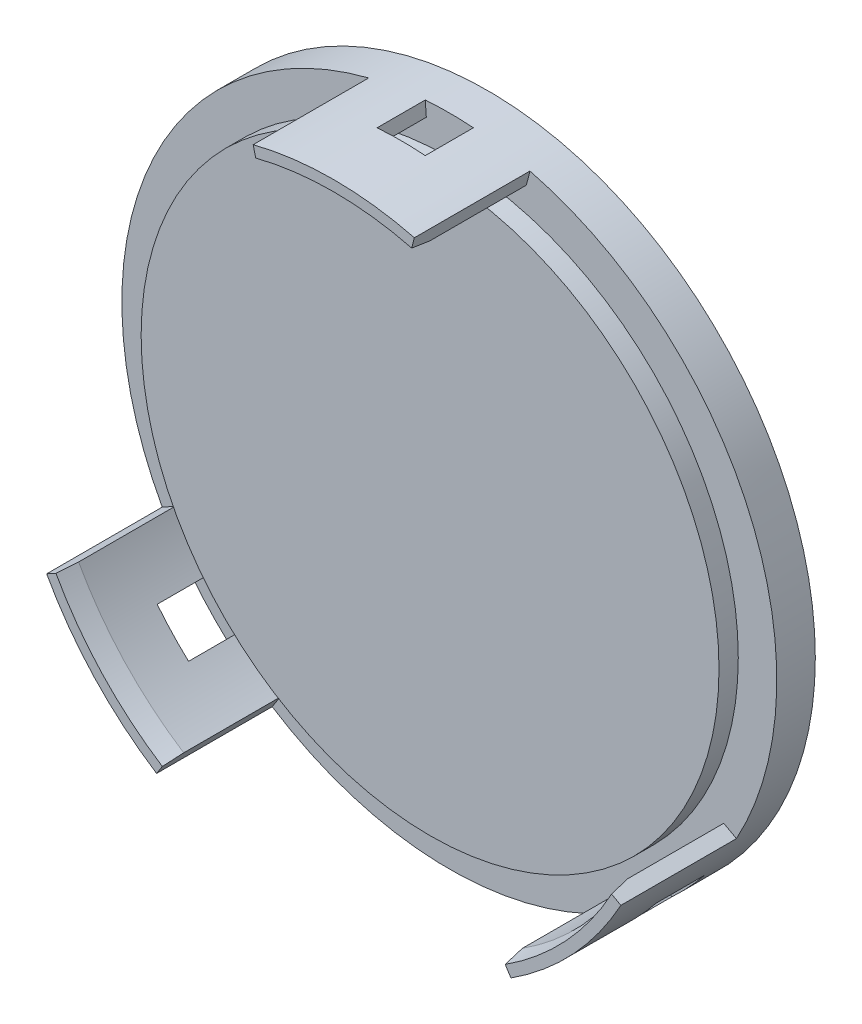
ISO-10303-21;
HEADER;
FILE_DESCRIPTION(('STEP AP214'),'2;1');
FILE_NAME('part.step','',(''),(''),'','','');
FILE_SCHEMA(('AUTOMOTIVE_DESIGN { 1 0 10303 214 1 1 1 1 }'));
ENDSEC;
DATA;
#1=APPLICATION_CONTEXT('core data for automotive mechanical design processes');
#2=APPLICATION_PROTOCOL_DEFINITION('international standard','automotive_design',2000,#1);
#3=PRODUCT_CONTEXT('',#1,'mechanical');
#4=PRODUCT('Part','Part','',(#3));
#5=PRODUCT_RELATED_PRODUCT_CATEGORY('part','',(#4));
#6=PRODUCT_DEFINITION_FORMATION('','',#4);
#7=PRODUCT_DEFINITION_CONTEXT('part definition',#1,'design');
#8=PRODUCT_DEFINITION('design','',#6,#7);
#9=PRODUCT_DEFINITION_SHAPE('','',#8);
#10=(LENGTH_UNIT() NAMED_UNIT(*) SI_UNIT(.MILLI.,.METRE.));
#11=(NAMED_UNIT(*) PLANE_ANGLE_UNIT() SI_UNIT($,.RADIAN.));
#12=(NAMED_UNIT(*) SI_UNIT($,.STERADIAN.) SOLID_ANGLE_UNIT());
#13=UNCERTAINTY_MEASURE_WITH_UNIT(LENGTH_MEASURE(1.E-05),#10,'distance_accuracy_value','');
#14=(GEOMETRIC_REPRESENTATION_CONTEXT(3) GLOBAL_UNCERTAINTY_ASSIGNED_CONTEXT((#13)) GLOBAL_UNIT_ASSIGNED_CONTEXT((#10,
#11,#12)) REPRESENTATION_CONTEXT('',''));
#15=CARTESIAN_POINT('',(0.,0.,0.));
#16=DIRECTION('',(0.,0.,1.));
#17=DIRECTION('',(1.,0.,0.));
#18=AXIS2_PLACEMENT_3D('',#15,#16,#17);
#19=CARTESIAN_POINT('',(0.,0.,2.));
#20=DIRECTION('',(0.,0.,1.));
#21=DIRECTION('',(1.,0.,0.));
#22=AXIS2_PLACEMENT_3D('',#19,#20,#21);
#23=PLANE('',#22);
#24=CARTESIAN_POINT('',(0.,0.,2.));
#25=DIRECTION('',(0.,0.,1.));
#26=DIRECTION('',(1.,0.,0.));
#27=AXIS2_PLACEMENT_3D('',#24,#25,#26);
#28=CIRCLE('',#27,15.);
#29=CARTESIAN_POINT('',(15.,0.,2.));
#30=VERTEX_POINT('',#29);
#31=EDGE_CURVE('E397',#30,#30,#28,.T.);
#32=ORIENTED_EDGE('',*,*,#31,.F.);
#33=EDGE_LOOP('',(#32));
#34=FACE_BOUND('',#33,.T.);
#35=CARTESIAN_POINT('',(0.,0.,2.));
#36=DIRECTION('',(0.,0.,1.));
#37=DIRECTION('',(-0.681998360062502,0.731353701619167,0.));
#38=AXIS2_PLACEMENT_3D('',#35,#36,#37);
#39=CIRCLE('',#38,16.2500000000001);
#40=CARTESIAN_POINT('',(-8.79082736025187,-13.6668889774611,2.));
#41=VERTEX_POINT('',#40);
#42=CARTESIAN_POINT('',(-11.0374391522415,-11.9263337602369,2.));
#43=VERTEX_POINT('',#42);
#44=EDGE_CURVE('E297',#41,#43,#39,.F.);
#45=ORIENTED_EDGE('',*,*,#44,.F.);
#46=DIRECTION('',(0.540973991400115,0.841039321689913,0.));
#47=VECTOR('',#46,1.);
#48=CARTESIAN_POINT('',(0.,0.,2.));
#49=LINE('',#48,#47);
#50=CARTESIAN_POINT('',(-9.19655785380195,-14.2976684687285,2.));
#51=VERTEX_POINT('',#50);
#52=EDGE_CURVE('E292',#51,#41,#49,.T.);
#53=ORIENTED_EDGE('',*,*,#52,.F.);
#54=CARTESIAN_POINT('',(0.,0.,2.));
#55=DIRECTION('',(0.,0.,1.));
#56=DIRECTION('',(1.,0.,0.));
#57=AXIS2_PLACEMENT_3D('',#54,#55,#56);
#58=CIRCLE('',#57,17.);
#59=CARTESIAN_POINT('',(9.19655785380194,-14.2976684687285,2.));
#60=VERTEX_POINT('',#59);
#61=EDGE_CURVE('E404',#51,#60,#58,.T.);
#62=ORIENTED_EDGE('',*,*,#61,.T.);
#63=DIRECTION('',(-0.540973991400114,0.841039321689914,0.));
#64=VECTOR('',#63,1.);
#65=CARTESIAN_POINT('',(0.,0.,2.));
#66=LINE('',#65,#64);
#67=CARTESIAN_POINT('',(8.79082736025186,-13.6668889774611,2.));
#68=VERTEX_POINT('',#67);
#69=EDGE_CURVE('E316',#60,#68,#66,.T.);
#70=ORIENTED_EDGE('',*,*,#69,.T.);
#71=CARTESIAN_POINT('',(0.,0.,2.));
#72=DIRECTION('',(0.,0.,1.));
#73=DIRECTION('',(-0.681998360062502,-0.731353701619167,0.));
#74=AXIS2_PLACEMENT_3D('',#71,#72,#73);
#75=CIRCLE('',#74,16.2500000000001);
#76=CARTESIAN_POINT('',(11.0374391522415,-11.9263337602369,2.));
#77=VERTEX_POINT('',#76);
#78=EDGE_CURVE('E324',#77,#68,#75,.F.);
#79=ORIENTED_EDGE('',*,*,#78,.F.);
#80=DIRECTION('',(-0.679227024753326,0.733928231399191,0.));
#81=VECTOR('',#80,1.);
#82=CARTESIAN_POINT('',(0.,0.,2.));
#83=LINE('',#82,#81);
#84=CARTESIAN_POINT('',(11.5468594208065,-12.4767799337863,2.));
#85=VERTEX_POINT('',#84);
#86=EDGE_CURVE('E241',#85,#77,#83,.T.);
#87=ORIENTED_EDGE('',*,*,#86,.F.);
#88=CARTESIAN_POINT('',(0.,0.,2.));
#89=DIRECTION('',(0.,0.,1.));
#90=DIRECTION('',(1.,0.,0.));
#91=AXIS2_PLACEMENT_3D('',#88,#89,#90);
#92=CIRCLE('',#91,17.);
#93=CARTESIAN_POINT('',(13.2518553209628,-10.6483956797383,2.));
#94=VERTEX_POINT('',#93);
#95=EDGE_CURVE('E761',#85,#94,#92,.T.);
#96=ORIENTED_EDGE('',*,*,#95,.T.);
#97=DIRECTION('',(-0.779520901233106,0.626376216455195,0.));
#98=VECTOR('',#97,1.);
#99=CARTESIAN_POINT('',(0.,0.,2.));
#100=LINE('',#99,#98);
#101=CARTESIAN_POINT('',(12.667214645038,-10.1786135173969,2.));
#102=VERTEX_POINT('',#101);
#103=EDGE_CURVE('E274',#94,#102,#100,.T.);
#104=ORIENTED_EDGE('',*,*,#103,.T.);
#105=CARTESIAN_POINT('',(14.2468142407519,-7.81605936450774,2.));
#106=VERTEX_POINT('',#105);
#107=EDGE_CURVE('E246',#106,#102,#75,.F.);
#108=ORIENTED_EDGE('',*,*,#107,.F.);
#109=DIRECTION('',(-0.876727030200116,0.480988268585092,0.));
#110=VECTOR('',#109,1.);
#111=CARTESIAN_POINT('',(0.,0.,2.));
#112=LINE('',#111,#110);
#113=CARTESIAN_POINT('',(14.904359513402,-8.17680056594656,2.));
#114=VERTEX_POINT('',#113);
#115=EDGE_CURVE('E311',#114,#106,#112,.T.);
#116=ORIENTED_EDGE('',*,*,#115,.F.);
#117=CARTESIAN_POINT('',(4.18461538461541,16.4769230769231,2.));
#118=VERTEX_POINT('',#117);
#119=EDGE_CURVE('E405',#114,#118,#58,.T.);
#120=ORIENTED_EDGE('',*,*,#119,.T.);
#121=DIRECTION('',(-0.246153846153847,-0.969230769230769,0.));
#122=VECTOR('',#121,1.);
#123=CARTESIAN_POINT('',(0.,0.,2.));
#124=LINE('',#123,#122);
#125=CARTESIAN_POINT('',(4.00000000000002,15.75,2.));
#126=VERTEX_POINT('',#125);
#127=EDGE_CURVE('E371',#118,#126,#124,.T.);
#128=ORIENTED_EDGE('',*,*,#127,.T.);
#129=CARTESIAN_POINT('',(0.,0.,2.));
#130=DIRECTION('',(0.,0.,1.));
#131=DIRECTION('',(1.,0.,0.));
#132=AXIS2_PLACEMENT_3D('',#129,#130,#131);
#133=CIRCLE('',#132,16.2500000000001);
#134=CARTESIAN_POINT('',(1.19485294117648,16.2060120464278,2.));
#135=VERTEX_POINT('',#134);
#136=EDGE_CURVE('E379',#135,#126,#133,.F.);
#137=ORIENTED_EDGE('',*,*,#136,.F.);
#138=DIRECTION('',(-0.0735294117647064,-0.99729304901094,0.));
#139=VECTOR('',#138,1.);
#140=CARTESIAN_POINT('',(0.,0.,2.));
#141=LINE('',#140,#139);
#142=CARTESIAN_POINT('',(1.25000000000001,16.953981833186,2.));
#143=VERTEX_POINT('',#142);
#144=EDGE_CURVE('E342',#143,#135,#141,.T.);
#145=ORIENTED_EDGE('',*,*,#144,.F.);
#146=CARTESIAN_POINT('',(0.,0.,2.));
#147=DIRECTION('',(0.,0.,1.));
#148=DIRECTION('',(1.,0.,0.));
#149=AXIS2_PLACEMENT_3D('',#146,#147,#148);
#150=CIRCLE('',#149,17.);
#151=CARTESIAN_POINT('',(-1.25000000000001,16.953981833186,2.));
#152=VERTEX_POINT('',#151);
#153=EDGE_CURVE('E352',#143,#152,#150,.T.);
#154=ORIENTED_EDGE('',*,*,#153,.T.);
#155=DIRECTION('',(0.0735294117647064,-0.99729304901094,0.));
#156=VECTOR('',#155,1.);
#157=CARTESIAN_POINT('',(0.,0.,2.));
#158=LINE('',#157,#156);
#159=CARTESIAN_POINT('',(-1.19485294117648,16.2060120464278,2.));
#160=VERTEX_POINT('',#159);
#161=EDGE_CURVE('E337',#152,#160,#158,.T.);
#162=ORIENTED_EDGE('',*,*,#161,.T.);
#163=CARTESIAN_POINT('',(-4.,15.75,2.));
#164=VERTEX_POINT('',#163);
#165=EDGE_CURVE('E380',#164,#160,#133,.F.);
#166=ORIENTED_EDGE('',*,*,#165,.F.);
#167=DIRECTION('',(0.246153846153846,-0.969230769230769,0.));
#168=VECTOR('',#167,1.);
#169=CARTESIAN_POINT('',(0.,0.,2.));
#170=LINE('',#169,#168);
#171=CARTESIAN_POINT('',(-4.18461538461539,16.4769230769231,2.));
#172=VERTEX_POINT('',#171);
#173=EDGE_CURVE('E358',#172,#164,#170,.T.);
#174=ORIENTED_EDGE('',*,*,#173,.F.);
#175=CARTESIAN_POINT('',(-14.904359513402,-8.17680056594654,2.));
#176=VERTEX_POINT('',#175);
#177=EDGE_CURVE('E401',#172,#176,#58,.T.);
#178=ORIENTED_EDGE('',*,*,#177,.T.);
#179=DIRECTION('',(0.876727030200117,0.480988268585091,0.));
#180=VECTOR('',#179,1.);
#181=CARTESIAN_POINT('',(0.,0.,2.));
#182=LINE('',#181,#180);
#183=CARTESIAN_POINT('',(-14.2468142407519,-7.81605936450773,2.));
#184=VERTEX_POINT('',#183);
#185=EDGE_CURVE('E287',#176,#184,#182,.T.);
#186=ORIENTED_EDGE('',*,*,#185,.T.);
#187=CARTESIAN_POINT('',(-12.667214645038,-10.1786135173969,2.));
#188=VERTEX_POINT('',#187);
#189=EDGE_CURVE('E295',#188,#184,#39,.F.);
#190=ORIENTED_EDGE('',*,*,#189,.F.);
#191=DIRECTION('',(0.779520901233106,0.626376216455195,0.));
#192=VECTOR('',#191,1.);
#193=CARTESIAN_POINT('',(0.,0.,2.));
#194=LINE('',#193,#192);
#195=CARTESIAN_POINT('',(-13.2518553209628,-10.6483956797383,2.));
#196=VERTEX_POINT('',#195);
#197=EDGE_CURVE('E257',#196,#188,#194,.T.);
#198=ORIENTED_EDGE('',*,*,#197,.F.);
#199=CARTESIAN_POINT('',(0.,0.,2.));
#200=DIRECTION('',(0.,0.,1.));
#201=DIRECTION('',(1.,0.,0.));
#202=AXIS2_PLACEMENT_3D('',#199,#200,#201);
#203=CIRCLE('',#202,17.);
#204=CARTESIAN_POINT('',(-11.5468594208065,-12.4767799337863,2.));
#205=VERTEX_POINT('',#204);
#206=EDGE_CURVE('E268',#196,#205,#203,.T.);
#207=ORIENTED_EDGE('',*,*,#206,.T.);
#208=DIRECTION('',(0.679227024753326,0.733928231399191,0.));
#209=VECTOR('',#208,1.);
#210=CARTESIAN_POINT('',(0.,0.,2.));
#211=LINE('',#210,#209);
#212=EDGE_CURVE('E266',#205,#43,#211,.T.);
#213=ORIENTED_EDGE('',*,*,#212,.T.);
#214=EDGE_LOOP('',(#45,#53,#62,#70,#79,#87,#96,#104,#108,#116,#120,#128,#137,#145,#154,#162,
#166,#174,#178,#186,#190,#198,#207,#213));
#215=FACE_BOUND('',#214,.T.);
#216=ADVANCED_FACE('F42',(#34,#215),#23,.T.);
#217=CARTESIAN_POINT('',(0.,0.,0.));
#218=DIRECTION('',(0.,0.,1.));
#219=DIRECTION('',(1.,0.,0.));
#220=AXIS2_PLACEMENT_3D('',#217,#218,#219);
#221=PLANE('',#220);
#222=CARTESIAN_POINT('',(0.,0.,0.));
#223=DIRECTION('',(0.,0.,1.));
#224=DIRECTION('',(1.,0.,0.));
#225=AXIS2_PLACEMENT_3D('',#222,#223,#224);
#226=CIRCLE('',#225,17.);
#227=CARTESIAN_POINT('',(17.,0.,0.));
#228=VERTEX_POINT('',#227);
#229=EDGE_CURVE('E400',#228,#228,#226,.T.);
#230=ORIENTED_EDGE('',*,*,#229,.F.);
#231=EDGE_LOOP('',(#230));
#232=FACE_BOUND('',#231,.T.);
#233=ADVANCED_FACE('F452',(#232),#221,.F.);
#234=CARTESIAN_POINT('',(0.,0.,2.));
#235=DIRECTION('',(0.,0.,-1.));
#236=DIRECTION('',(-1.,0.,0.));
#237=AXIS2_PLACEMENT_3D('',#234,#235,#236);
#238=CYLINDRICAL_SURFACE('',#237,17.);
#239=DIRECTION('',(0.,0.,-1.));
#240=VECTOR('',#239,1.);
#241=CARTESIAN_POINT('',(11.5468594208065,-12.4767799337863,4.5));
#242=LINE('',#241,#240);
#243=CARTESIAN_POINT('',(11.5468594208065,-12.4767799337863,4.5));
#244=VERTEX_POINT('',#243);
#245=EDGE_CURVE('E248',#244,#85,#242,.T.);
#246=ORIENTED_EDGE('',*,*,#245,.F.);
#247=CARTESIAN_POINT('',(0.,0.,4.5));
#248=DIRECTION('',(0.,0.,1.));
#249=DIRECTION('',(1.,0.,0.));
#250=AXIS2_PLACEMENT_3D('',#247,#248,#249);
#251=CIRCLE('',#250,17.);
#252=CARTESIAN_POINT('',(13.2518553209628,-10.6483956797383,4.5));
#253=VERTEX_POINT('',#252);
#254=EDGE_CURVE('E231',#244,#253,#251,.T.);
#255=ORIENTED_EDGE('',*,*,#254,.T.);
#256=DIRECTION('',(0.,0.,-1.));
#257=VECTOR('',#256,1.);
#258=CARTESIAN_POINT('',(13.2518553209628,-10.6483956797383,4.5));
#259=LINE('',#258,#257);
#260=EDGE_CURVE('E228',#253,#94,#259,.T.);
#261=ORIENTED_EDGE('',*,*,#260,.T.);
#262=ORIENTED_EDGE('',*,*,#95,.F.);
#263=EDGE_LOOP('',(#246,#255,#261,#262));
#264=FACE_BOUND('',#263,.T.);
#265=DIRECTION('',(0.,0.,-1.));
#266=VECTOR('',#265,1.);
#267=CARTESIAN_POINT('',(-13.2518553209628,-10.6483956797383,4.5));
#268=LINE('',#267,#266);
#269=CARTESIAN_POINT('',(-13.2518553209628,-10.6483956797383,4.5));
#270=VERTEX_POINT('',#269);
#271=EDGE_CURVE('E275',#270,#196,#268,.T.);
#272=ORIENTED_EDGE('',*,*,#271,.F.);
#273=CARTESIAN_POINT('',(0.,0.,4.5));
#274=DIRECTION('',(0.,0.,1.));
#275=DIRECTION('',(1.,0.,0.));
#276=AXIS2_PLACEMENT_3D('',#273,#274,#275);
#277=CIRCLE('',#276,17.);
#278=CARTESIAN_POINT('',(-11.5468594208065,-12.4767799337863,4.5));
#279=VERTEX_POINT('',#278);
#280=EDGE_CURVE('E259',#270,#279,#277,.T.);
#281=ORIENTED_EDGE('',*,*,#280,.T.);
#282=DIRECTION('',(0.,0.,-1.));
#283=VECTOR('',#282,1.);
#284=CARTESIAN_POINT('',(-11.5468594208065,-12.4767799337863,4.5));
#285=LINE('',#284,#283);
#286=EDGE_CURVE('E278',#279,#205,#285,.T.);
#287=ORIENTED_EDGE('',*,*,#286,.T.);
#288=ORIENTED_EDGE('',*,*,#206,.F.);
#289=EDGE_LOOP('',(#272,#281,#287,#288));
#290=FACE_BOUND('',#289,.T.);
#291=DIRECTION('',(0.,0.,-1.));
#292=VECTOR('',#291,1.);
#293=CARTESIAN_POINT('',(1.25000000000001,16.953981833186,4.5));
#294=LINE('',#293,#292);
#295=CARTESIAN_POINT('',(1.25000000000001,16.953981833186,4.5));
#296=VERTEX_POINT('',#295);
#297=EDGE_CURVE('E359',#296,#143,#294,.T.);
#298=ORIENTED_EDGE('',*,*,#297,.F.);
#299=CARTESIAN_POINT('',(0.,0.,4.5));
#300=DIRECTION('',(0.,0.,1.));
#301=DIRECTION('',(1.,0.,0.));
#302=AXIS2_PLACEMENT_3D('',#299,#300,#301);
#303=CIRCLE('',#302,17.);
#304=CARTESIAN_POINT('',(-1.25000000000001,16.953981833186,4.5));
#305=VERTEX_POINT('',#304);
#306=EDGE_CURVE('E344',#296,#305,#303,.T.);
#307=ORIENTED_EDGE('',*,*,#306,.T.);
#308=DIRECTION('',(0.,0.,-1.));
#309=VECTOR('',#308,1.);
#310=CARTESIAN_POINT('',(-1.25000000000001,16.953981833186,4.5));
#311=LINE('',#310,#309);
#312=EDGE_CURVE('E362',#305,#152,#311,.T.);
#313=ORIENTED_EDGE('',*,*,#312,.T.);
#314=ORIENTED_EDGE('',*,*,#153,.F.);
#315=EDGE_LOOP('',(#298,#307,#313,#314));
#316=FACE_BOUND('',#315,.T.);
#317=ORIENTED_EDGE('',*,*,#177,.F.);
#318=DIRECTION('',(0.,0.,-1.));
#319=VECTOR('',#318,1.);
#320=CARTESIAN_POINT('',(-4.18461538461539,16.4769230769231,8.));
#321=LINE('',#320,#319);
#322=CARTESIAN_POINT('',(-4.18461538461539,16.4769230769231,8.));
#323=VERTEX_POINT('',#322);
#324=EDGE_CURVE('E376',#323,#172,#321,.T.);
#325=ORIENTED_EDGE('',*,*,#324,.F.);
#326=CARTESIAN_POINT('',(0.,0.,8.));
#327=DIRECTION('',(0.,0.,1.));
#328=DIRECTION('',(1.,0.,0.));
#329=AXIS2_PLACEMENT_3D('',#326,#327,#328);
#330=CIRCLE('',#329,17.);
#331=CARTESIAN_POINT('',(4.18461538461541,16.4769230769231,8.));
#332=VERTEX_POINT('',#331);
#333=EDGE_CURVE('E374',#332,#323,#330,.T.);
#334=ORIENTED_EDGE('',*,*,#333,.F.);
#335=DIRECTION('',(0.,0.,-1.));
#336=VECTOR('',#335,1.);
#337=CARTESIAN_POINT('',(4.18461538461541,16.4769230769231,8.));
#338=LINE('',#337,#336);
#339=EDGE_CURVE('E387',#332,#118,#338,.T.);
#340=ORIENTED_EDGE('',*,*,#339,.T.);
#341=ORIENTED_EDGE('',*,*,#119,.F.);
#342=DIRECTION('',(0.,0.,-1.));
#343=VECTOR('',#342,1.);
#344=CARTESIAN_POINT('',(14.904359513402,-8.17680056594656,8.));
#345=LINE('',#344,#343);
#346=CARTESIAN_POINT('',(14.904359513402,-8.17680056594656,8.));
#347=VERTEX_POINT('',#346);
#348=EDGE_CURVE('E321',#347,#114,#345,.T.);
#349=ORIENTED_EDGE('',*,*,#348,.F.);
#350=CARTESIAN_POINT('',(0.,0.,8.));
#351=DIRECTION('',(0.,0.,1.));
#352=DIRECTION('',(-0.681998360062502,-0.731353701619167,0.));
#353=AXIS2_PLACEMENT_3D('',#350,#351,#352);
#354=CIRCLE('',#353,17.);
#355=CARTESIAN_POINT('',(9.19655785380194,-14.2976684687285,8.));
#356=VERTEX_POINT('',#355);
#357=EDGE_CURVE('E319',#356,#347,#354,.T.);
#358=ORIENTED_EDGE('',*,*,#357,.F.);
#359=DIRECTION('',(0.,0.,-1.));
#360=VECTOR('',#359,1.);
#361=CARTESIAN_POINT('',(9.19655785380194,-14.2976684687285,8.));
#362=LINE('',#361,#360);
#363=EDGE_CURVE('E330',#356,#60,#362,.T.);
#364=ORIENTED_EDGE('',*,*,#363,.T.);
#365=ORIENTED_EDGE('',*,*,#61,.F.);
#366=DIRECTION('',(0.,0.,-1.));
#367=VECTOR('',#366,1.);
#368=CARTESIAN_POINT('',(-9.19655785380195,-14.2976684687285,8.));
#369=LINE('',#368,#367);
#370=CARTESIAN_POINT('',(-9.19655785380195,-14.2976684687285,8.));
#371=VERTEX_POINT('',#370);
#372=EDGE_CURVE('E291',#371,#51,#369,.T.);
#373=ORIENTED_EDGE('',*,*,#372,.F.);
#374=CARTESIAN_POINT('',(0.,0.,8.));
#375=DIRECTION('',(0.,0.,1.));
#376=DIRECTION('',(-0.681998360062502,0.731353701619167,0.));
#377=AXIS2_PLACEMENT_3D('',#374,#375,#376);
#378=CIRCLE('',#377,17.);
#379=CARTESIAN_POINT('',(-14.904359513402,-8.17680056594654,8.));
#380=VERTEX_POINT('',#379);
#381=EDGE_CURVE('E289',#380,#371,#378,.T.);
#382=ORIENTED_EDGE('',*,*,#381,.F.);
#383=DIRECTION('',(0.,0.,-1.));
#384=VECTOR('',#383,1.);
#385=CARTESIAN_POINT('',(-14.904359513402,-8.17680056594654,8.));
#386=LINE('',#385,#384);
#387=EDGE_CURVE('E304',#380,#176,#386,.T.);
#388=ORIENTED_EDGE('',*,*,#387,.T.);
#389=EDGE_LOOP('',(#317,#325,#334,#340,#341,#349,#358,#364,#365,#373,#382,#388));
#390=FACE_BOUND('',#389,.T.);
#391=ORIENTED_EDGE('',*,*,#229,.T.);
#392=EDGE_LOOP('',(#391));
#393=FACE_BOUND('',#392,.T.);
#394=ADVANCED_FACE('F440',(#264,#290,#316,#390,#393),#238,.T.);
#395=CARTESIAN_POINT('',(0.,0.,46.4264068711929));
#396=DIRECTION('',(0.,0.,-1.));
#397=DIRECTION('',(-1.,0.,0.));
#398=AXIS2_PLACEMENT_3D('',#395,#396,#397);
#399=CYLINDRICAL_SURFACE('',#398,15.);
#400=ORIENTED_EDGE('',*,*,#31,.T.);
#401=EDGE_LOOP('',(#400));
#402=FACE_BOUND('',#401,.T.);
#403=CARTESIAN_POINT('',(0.,0.,3.));
#404=DIRECTION('',(0.,0.,1.));
#405=DIRECTION('',(1.,0.,0.));
#406=AXIS2_PLACEMENT_3D('',#403,#404,#405);
#407=CIRCLE('',#406,15.);
#408=CARTESIAN_POINT('',(15.,0.,3.));
#409=VERTEX_POINT('',#408);
#410=EDGE_CURVE('E394',#409,#409,#407,.T.);
#411=ORIENTED_EDGE('',*,*,#410,.F.);
#412=EDGE_LOOP('',(#411));
#413=FACE_BOUND('',#412,.T.);
#414=ADVANCED_FACE('F468',(#402,#413),#399,.T.);
#415=CARTESIAN_POINT('',(0.,0.,3.));
#416=DIRECTION('',(0.,0.,1.));
#417=DIRECTION('',(1.,0.,0.));
#418=AXIS2_PLACEMENT_3D('',#415,#416,#417);
#419=PLANE('',#418);
#420=ORIENTED_EDGE('',*,*,#410,.T.);
#421=EDGE_LOOP('',(#420));
#422=FACE_BOUND('',#421,.T.);
#423=ADVANCED_FACE('F463',(#422),#419,.T.);
#424=CARTESIAN_POINT('',(0.,0.,8.));
#425=DIRECTION('',(0.969230769230769,0.246153846153846,0.));
#426=DIRECTION('',(-0.246153846153846,0.969230769230769,0.));
#427=AXIS2_PLACEMENT_3D('',#424,#425,#426);
#428=PLANE('',#427);
#429=DIRECTION('',(0.,0.,-1.));
#430=VECTOR('',#429,1.);
#431=CARTESIAN_POINT('',(-4.,15.75,8.));
#432=LINE('',#431,#430);
#433=CARTESIAN_POINT('',(-4.,15.75,7.00000000000006));
#434=VERTEX_POINT('',#433);
#435=EDGE_CURVE('E392',#434,#164,#432,.T.);
#436=ORIENTED_EDGE('',*,*,#435,.F.);
#437=DIRECTION('',(-0.0482747409570909,0.190081792518545,0.980580675690921));
#438=VECTOR('',#437,1.);
#439=CARTESIAN_POINT('',(0.,0.,-74.2500000000013));
#440=LINE('',#439,#438);
#441=CARTESIAN_POINT('',(-4.04923076923077,15.9438461538461,8.));
#442=VERTEX_POINT('',#441);
#443=EDGE_CURVE('E414',#434,#442,#440,.T.);
#444=ORIENTED_EDGE('',*,*,#443,.T.);
#445=DIRECTION('',(0.246153846153846,-0.969230769230769,0.));
#446=VECTOR('',#445,1.);
#447=CARTESIAN_POINT('',(0.,0.,8.));
#448=LINE('',#447,#446);
#449=EDGE_CURVE('E367',#323,#442,#448,.T.);
#450=ORIENTED_EDGE('',*,*,#449,.F.);
#451=ORIENTED_EDGE('',*,*,#324,.T.);
#452=ORIENTED_EDGE('',*,*,#173,.T.);
#453=EDGE_LOOP('',(#436,#444,#450,#451,#452));
#454=FACE_BOUND('',#453,.T.);
#455=ADVANCED_FACE('F498',(#454),#428,.F.);
#456=CARTESIAN_POINT('',(0.,0.,8.));
#457=DIRECTION('',(0.,0.,-1.));
#458=DIRECTION('',(-1.,0.,0.));
#459=AXIS2_PLACEMENT_3D('',#456,#457,#458);
#460=CYLINDRICAL_SURFACE('',#459,16.2500000000001);
#461=DIRECTION('',(0.,0.,-1.));
#462=VECTOR('',#461,1.);
#463=CARTESIAN_POINT('',(4.00000000000002,15.75,8.));
#464=LINE('',#463,#462);
#465=CARTESIAN_POINT('',(4.00000000000002,15.75,7.00000000000006));
#466=VERTEX_POINT('',#465);
#467=EDGE_CURVE('E390',#466,#126,#464,.T.);
#468=ORIENTED_EDGE('',*,*,#467,.F.);
#469=CARTESIAN_POINT('',(0.,0.,7.00000000000006));
#470=DIRECTION('',(0.,0.,1.));
#471=DIRECTION('',(1.,0.,0.));
#472=AXIS2_PLACEMENT_3D('',#469,#470,#471);
#473=CIRCLE('',#472,16.2500000000001);
#474=EDGE_CURVE('E412',#466,#434,#473,.T.);
#475=ORIENTED_EDGE('',*,*,#474,.T.);
#476=ORIENTED_EDGE('',*,*,#435,.T.);
#477=ORIENTED_EDGE('',*,*,#165,.T.);
#478=DIRECTION('',(0.,0.,-1.));
#479=VECTOR('',#478,1.);
#480=CARTESIAN_POINT('',(-1.19485294117648,16.2060120464278,4.5));
#481=LINE('',#480,#479);
#482=CARTESIAN_POINT('',(-1.19485294117648,16.2060120464278,4.5));
#483=VERTEX_POINT('',#482);
#484=EDGE_CURVE('E350',#483,#160,#481,.T.);
#485=ORIENTED_EDGE('',*,*,#484,.F.);
#486=CARTESIAN_POINT('',(0.,0.,4.5));
#487=DIRECTION('',(0.,0.,1.));
#488=DIRECTION('',(1.,0.,0.));
#489=AXIS2_PLACEMENT_3D('',#486,#487,#488);
#490=CIRCLE('',#489,16.2500000000001);
#491=CARTESIAN_POINT('',(1.19485294117648,16.2060120464278,4.5));
#492=VERTEX_POINT('',#491);
#493=EDGE_CURVE('E338',#492,#483,#490,.T.);
#494=ORIENTED_EDGE('',*,*,#493,.F.);
#495=DIRECTION('',(0.,0.,-1.));
#496=VECTOR('',#495,1.);
#497=CARTESIAN_POINT('',(1.19485294117648,16.2060120464278,4.5));
#498=LINE('',#497,#496);
#499=EDGE_CURVE('E355',#492,#135,#498,.T.);
#500=ORIENTED_EDGE('',*,*,#499,.T.);
#501=ORIENTED_EDGE('',*,*,#136,.T.);
#502=EDGE_LOOP('',(#468,#475,#476,#477,#485,#494,#500,#501));
#503=FACE_BOUND('',#502,.T.);
#504=ADVANCED_FACE('F511',(#503),#460,.F.);
#505=CARTESIAN_POINT('',(0.,0.,8.));
#506=DIRECTION('',(0.969230769230769,-0.246153846153847,0.));
#507=DIRECTION('',(0.246153846153847,0.969230769230769,0.));
#508=AXIS2_PLACEMENT_3D('',#505,#506,#507);
#509=PLANE('',#508);
#510=DIRECTION('',(-0.246153846153847,-0.969230769230769,0.));
#511=VECTOR('',#510,1.);
#512=CARTESIAN_POINT('',(0.,0.,8.));
#513=LINE('',#512,#511);
#514=CARTESIAN_POINT('',(4.04923076923079,15.9438461538461,8.));
#515=VERTEX_POINT('',#514);
#516=EDGE_CURVE('E370',#332,#515,#513,.T.);
#517=ORIENTED_EDGE('',*,*,#516,.T.);
#518=DIRECTION('',(0.0482747409570911,0.190081792518545,0.980580675690921));
#519=VECTOR('',#518,1.);
#520=CARTESIAN_POINT('',(0.,0.,-74.2500000000013));
#521=LINE('',#520,#519);
#522=EDGE_CURVE('E410',#515,#466,#521,.F.);
#523=ORIENTED_EDGE('',*,*,#522,.T.);
#524=ORIENTED_EDGE('',*,*,#467,.T.);
#525=ORIENTED_EDGE('',*,*,#127,.F.);
#526=ORIENTED_EDGE('',*,*,#339,.F.);
#527=EDGE_LOOP('',(#517,#523,#524,#525,#526));
#528=FACE_BOUND('',#527,.T.);
#529=ADVANCED_FACE('F517',(#528),#509,.T.);
#530=CARTESIAN_POINT('',(0.,0.,8.));
#531=DIRECTION('',(0.,0.,1.));
#532=DIRECTION('',(1.,0.,0.));
#533=AXIS2_PLACEMENT_3D('',#530,#531,#532);
#534=PLANE('',#533);
#535=ORIENTED_EDGE('',*,*,#449,.T.);
#536=CARTESIAN_POINT('',(0.,0.,8.));
#537=DIRECTION('',(0.,0.,1.));
#538=DIRECTION('',(1.,0.,0.));
#539=AXIS2_PLACEMENT_3D('',#536,#537,#538);
#540=CIRCLE('',#539,16.45);
#541=EDGE_CURVE('E403',#442,#515,#540,.F.);
#542=ORIENTED_EDGE('',*,*,#541,.T.);
#543=ORIENTED_EDGE('',*,*,#516,.F.);
#544=ORIENTED_EDGE('',*,*,#333,.T.);
#545=EDGE_LOOP('',(#535,#542,#543,#544));
#546=FACE_BOUND('',#545,.T.);
#547=ADVANCED_FACE('F500',(#546),#534,.T.);
#548=CARTESIAN_POINT('',(0.,0.,4.5));
#549=DIRECTION('',(0.99729304901094,-0.0735294117647064,0.));
#550=DIRECTION('',(0.0735294117647064,0.99729304901094,0.));
#551=AXIS2_PLACEMENT_3D('',#548,#549,#550);
#552=PLANE('',#551);
#553=ORIENTED_EDGE('',*,*,#144,.T.);
#554=ORIENTED_EDGE('',*,*,#499,.F.);
#555=DIRECTION('',(-0.0735294117647064,-0.99729304901094,0.));
#556=VECTOR('',#555,1.);
#557=CARTESIAN_POINT('',(0.,0.,4.5));
#558=LINE('',#557,#556);
#559=EDGE_CURVE('E347',#296,#492,#558,.T.);
#560=ORIENTED_EDGE('',*,*,#559,.F.);
#561=ORIENTED_EDGE('',*,*,#297,.T.);
#562=EDGE_LOOP('',(#553,#554,#560,#561));
#563=FACE_BOUND('',#562,.T.);
#564=ADVANCED_FACE('F556',(#563),#552,.F.);
#565=CARTESIAN_POINT('',(0.,0.,4.5));
#566=DIRECTION('',(0.99729304901094,0.0735294117647064,0.));
#567=DIRECTION('',(-0.0735294117647064,0.99729304901094,0.));
#568=AXIS2_PLACEMENT_3D('',#565,#566,#567);
#569=PLANE('',#568);
#570=ORIENTED_EDGE('',*,*,#161,.F.);
#571=ORIENTED_EDGE('',*,*,#312,.F.);
#572=DIRECTION('',(0.0735294117647064,-0.99729304901094,0.));
#573=VECTOR('',#572,1.);
#574=CARTESIAN_POINT('',(0.,0.,4.5));
#575=LINE('',#574,#573);
#576=EDGE_CURVE('E341',#305,#483,#575,.T.);
#577=ORIENTED_EDGE('',*,*,#576,.T.);
#578=ORIENTED_EDGE('',*,*,#484,.T.);
#579=EDGE_LOOP('',(#570,#571,#577,#578));
#580=FACE_BOUND('',#579,.T.);
#581=ADVANCED_FACE('F489',(#580),#569,.T.);
#582=CARTESIAN_POINT('',(0.,0.,4.5));
#583=DIRECTION('',(0.,0.,1.));
#584=DIRECTION('',(1.,0.,0.));
#585=AXIS2_PLACEMENT_3D('',#582,#583,#584);
#586=PLANE('',#585);
#587=ORIENTED_EDGE('',*,*,#493,.T.);
#588=ORIENTED_EDGE('',*,*,#576,.F.);
#589=ORIENTED_EDGE('',*,*,#306,.F.);
#590=ORIENTED_EDGE('',*,*,#559,.T.);
#591=EDGE_LOOP('',(#587,#588,#589,#590));
#592=FACE_BOUND('',#591,.T.);
#593=ADVANCED_FACE('F477',(#592),#586,.F.);
#594=CARTESIAN_POINT('',(0.,0.,8.));
#595=DIRECTION('',(0.,0.,1.));
#596=DIRECTION('',(1.,0.,0.));
#597=AXIS2_PLACEMENT_3D('',#594,#595,#596);
#598=CONICAL_SURFACE('',#597,16.45,0.197395559849878);
#599=ORIENTED_EDGE('',*,*,#443,.F.);
#600=ORIENTED_EDGE('',*,*,#474,.F.);
#601=ORIENTED_EDGE('',*,*,#522,.F.);
#602=ORIENTED_EDGE('',*,*,#541,.F.);
#603=EDGE_LOOP('',(#599,#600,#601,#602));
#604=FACE_BOUND('',#603,.T.);
#605=ADVANCED_FACE('F471',(#604),#598,.F.);
#606=CARTESIAN_POINT('',(0.,0.,8.));
#607=DIRECTION('',(-0.480988268585092,-0.876727030200116,0.));
#608=DIRECTION('',(0.876727030200116,-0.480988268585092,0.));
#609=AXIS2_PLACEMENT_3D('',#606,#607,#608);
#610=PLANE('',#609);
#611=DIRECTION('',(0.,0.,-1.));
#612=VECTOR('',#611,1.);
#613=CARTESIAN_POINT('',(14.2468142407519,-7.81605936450774,8.));
#614=LINE('',#613,#612);
#615=CARTESIAN_POINT('',(14.2468142407519,-7.81605936450774,6.9999999999999));
#616=VERTEX_POINT('',#615);
#617=EDGE_CURVE('E335',#616,#106,#614,.T.);
#618=ORIENTED_EDGE('',*,*,#617,.F.);
#619=DIRECTION('',(0.171940316734024,-0.0943295602817144,0.98058067569092));
#620=VECTOR('',#619,1.);
#621=CARTESIAN_POINT('',(0.,0.,-74.250000000001));
#622=LINE('',#621,#620);
#623=CARTESIAN_POINT('',(14.4221596467919,-7.91225701822477,8.));
#624=VERTEX_POINT('',#623);
#625=EDGE_CURVE('E423',#616,#624,#622,.T.);
#626=ORIENTED_EDGE('',*,*,#625,.T.);
#627=DIRECTION('',(-0.876727030200116,0.480988268585092,0.));
#628=VECTOR('',#627,1.);
#629=CARTESIAN_POINT('',(0.,0.,8.));
#630=LINE('',#629,#628);
#631=EDGE_CURVE('E312',#347,#624,#630,.T.);
#632=ORIENTED_EDGE('',*,*,#631,.F.);
#633=ORIENTED_EDGE('',*,*,#348,.T.);
#634=ORIENTED_EDGE('',*,*,#115,.T.);
#635=EDGE_LOOP('',(#618,#626,#632,#633,#634));
#636=FACE_BOUND('',#635,.T.);
#637=ADVANCED_FACE('F476',(#636),#610,.F.);
#638=CARTESIAN_POINT('',(0.,0.,8.));
#639=DIRECTION('',(0.,0.,-1.));
#640=DIRECTION('',(-1.,0.,0.));
#641=AXIS2_PLACEMENT_3D('',#638,#639,#640);
#642=CYLINDRICAL_SURFACE('',#641,16.2500000000001);
#643=DIRECTION('',(0.,0.,-1.));
#644=VECTOR('',#643,1.);
#645=CARTESIAN_POINT('',(8.79082736025186,-13.6668889774611,8.));
#646=LINE('',#645,#644);
#647=CARTESIAN_POINT('',(8.79082736025186,-13.6668889774611,6.9999999999999));
#648=VERTEX_POINT('',#647);
#649=EDGE_CURVE('E333',#648,#68,#646,.T.);
#650=ORIENTED_EDGE('',*,*,#649,.F.);
#651=CARTESIAN_POINT('',(0.,0.,6.9999999999999));
#652=DIRECTION('',(0.,0.,1.));
#653=DIRECTION('',(1.,0.,0.));
#654=AXIS2_PLACEMENT_3D('',#651,#652,#653);
#655=CIRCLE('',#654,16.2500000000001);
#656=EDGE_CURVE('E421',#648,#616,#655,.T.);
#657=ORIENTED_EDGE('',*,*,#656,.T.);
#658=ORIENTED_EDGE('',*,*,#617,.T.);
#659=ORIENTED_EDGE('',*,*,#107,.T.);
#660=DIRECTION('',(0.,0.,-1.));
#661=VECTOR('',#660,1.);
#662=CARTESIAN_POINT('',(12.667214645038,-10.1786135173969,4.5));
#663=LINE('',#662,#661);
#664=CARTESIAN_POINT('',(12.667214645038,-10.1786135173969,4.5));
#665=VERTEX_POINT('',#664);
#666=EDGE_CURVE('E225',#665,#102,#663,.T.);
#667=ORIENTED_EDGE('',*,*,#666,.F.);
#668=CARTESIAN_POINT('',(0.,0.,4.5));
#669=DIRECTION('',(0.,0.,1.));
#670=DIRECTION('',(1.,0.,0.));
#671=AXIS2_PLACEMENT_3D('',#668,#669,#670);
#672=CIRCLE('',#671,16.2500000000001);
#673=CARTESIAN_POINT('',(11.0374391522415,-11.9263337602369,4.5));
#674=VERTEX_POINT('',#673);
#675=EDGE_CURVE('E232',#674,#665,#672,.T.);
#676=ORIENTED_EDGE('',*,*,#675,.F.);
#677=DIRECTION('',(0.,0.,-1.));
#678=VECTOR('',#677,1.);
#679=CARTESIAN_POINT('',(11.0374391522415,-11.9263337602369,4.5));
#680=LINE('',#679,#678);
#681=EDGE_CURVE('E296',#674,#77,#680,.T.);
#682=ORIENTED_EDGE('',*,*,#681,.T.);
#683=ORIENTED_EDGE('',*,*,#78,.T.);
#684=EDGE_LOOP('',(#650,#657,#658,#659,#667,#676,#682,#683));
#685=FACE_BOUND('',#684,.T.);
#686=ADVANCED_FACE('F244',(#685),#642,.F.);
#687=CARTESIAN_POINT('',(0.,0.,8.));
#688=DIRECTION('',(-0.841039321689913,-0.540973991400114,0.));
#689=DIRECTION('',(0.540973991400114,-0.841039321689913,0.));
#690=AXIS2_PLACEMENT_3D('',#687,#688,#689);
#691=PLANE('',#690);
#692=DIRECTION('',(-0.540973991400114,0.841039321689914,0.));
#693=VECTOR('',#692,1.);
#694=CARTESIAN_POINT('',(0.,0.,8.));
#695=LINE('',#694,#693);
#696=CARTESIAN_POINT('',(8.8990221585319,-13.8350968417991,8.));
#697=VERTEX_POINT('',#696);
#698=EDGE_CURVE('E315',#356,#697,#695,.T.);
#699=ORIENTED_EDGE('',*,*,#698,.T.);
#700=DIRECTION('',(0.106093728403667,-0.164941381269065,0.980580675690921));
#701=VECTOR('',#700,1.);
#702=CARTESIAN_POINT('',(0.,0.,-74.250000000001));
#703=LINE('',#702,#701);
#704=EDGE_CURVE('E419',#697,#648,#703,.F.);
#705=ORIENTED_EDGE('',*,*,#704,.T.);
#706=ORIENTED_EDGE('',*,*,#649,.T.);
#707=ORIENTED_EDGE('',*,*,#69,.F.);
#708=ORIENTED_EDGE('',*,*,#363,.F.);
#709=EDGE_LOOP('',(#699,#705,#706,#707,#708));
#710=FACE_BOUND('',#709,.T.);
#711=ADVANCED_FACE('F530',(#710),#691,.T.);
#712=CARTESIAN_POINT('',(0.,0.,8.));
#713=DIRECTION('',(0.,0.,1.));
#714=DIRECTION('',(-0.681998360062502,-0.731353701619167,0.));
#715=AXIS2_PLACEMENT_3D('',#712,#713,#714);
#716=PLANE('',#715);
#717=ORIENTED_EDGE('',*,*,#631,.T.);
#718=CARTESIAN_POINT('',(0.,0.,8.));
#719=DIRECTION('',(0.,0.,1.));
#720=DIRECTION('',(1.,0.,0.));
#721=AXIS2_PLACEMENT_3D('',#718,#719,#720);
#722=CIRCLE('',#721,16.4500000000001);
#723=EDGE_CURVE('E416',#624,#697,#722,.F.);
#724=ORIENTED_EDGE('',*,*,#723,.T.);
#725=ORIENTED_EDGE('',*,*,#698,.F.);
#726=ORIENTED_EDGE('',*,*,#357,.T.);
#727=EDGE_LOOP('',(#717,#724,#725,#726));
#728=FACE_BOUND('',#727,.T.);
#729=ADVANCED_FACE('F526',(#728),#716,.T.);
#730=CARTESIAN_POINT('',(0.,0.,8.));
#731=DIRECTION('',(-0.841039321689913,0.540973991400115,0.));
#732=DIRECTION('',(-0.540973991400115,-0.841039321689913,0.));
#733=AXIS2_PLACEMENT_3D('',#730,#731,#732);
#734=PLANE('',#733);
#735=DIRECTION('',(0.,0.,-1.));
#736=VECTOR('',#735,1.);
#737=CARTESIAN_POINT('',(-8.79082736025187,-13.6668889774611,8.));
#738=LINE('',#737,#736);
#739=CARTESIAN_POINT('',(-8.79082736025187,-13.6668889774611,6.99999999999999));
#740=VERTEX_POINT('',#739);
#741=EDGE_CURVE('E309',#740,#41,#738,.T.);
#742=ORIENTED_EDGE('',*,*,#741,.F.);
#743=DIRECTION('',(-0.106093728403666,-0.164941381269063,0.980580675690921));
#744=VECTOR('',#743,1.);
#745=CARTESIAN_POINT('',(0.,0.,-74.2500000000014));
#746=LINE('',#745,#744);
#747=CARTESIAN_POINT('',(-8.89902215853189,-13.8350968417991,8.));
#748=VERTEX_POINT('',#747);
#749=EDGE_CURVE('E12',#740,#748,#746,.T.);
#750=ORIENTED_EDGE('',*,*,#749,.T.);
#751=DIRECTION('',(0.540973991400115,0.841039321689913,0.));
#752=VECTOR('',#751,1.);
#753=CARTESIAN_POINT('',(0.,0.,8.));
#754=LINE('',#753,#752);
#755=EDGE_CURVE('E283',#371,#748,#754,.T.);
#756=ORIENTED_EDGE('',*,*,#755,.F.);
#757=ORIENTED_EDGE('',*,*,#372,.T.);
#758=ORIENTED_EDGE('',*,*,#52,.T.);
#759=EDGE_LOOP('',(#742,#750,#756,#757,#758));
#760=FACE_BOUND('',#759,.T.);
#761=ADVANCED_FACE('F444',(#760),#734,.F.);
#762=CARTESIAN_POINT('',(0.,0.,8.));
#763=DIRECTION('',(0.,0.,-1.));
#764=DIRECTION('',(-1.,0.,0.));
#765=AXIS2_PLACEMENT_3D('',#762,#763,#764);
#766=CYLINDRICAL_SURFACE('',#765,16.2500000000001);
#767=DIRECTION('',(0.,0.,-1.));
#768=VECTOR('',#767,1.);
#769=CARTESIAN_POINT('',(-14.2468142407519,-7.81605936450773,8.));
#770=LINE('',#769,#768);
#771=CARTESIAN_POINT('',(-14.2468142407519,-7.81605936450773,6.99999999999999));
#772=VERTEX_POINT('',#771);
#773=EDGE_CURVE('E307',#772,#184,#770,.T.);
#774=ORIENTED_EDGE('',*,*,#773,.F.);
#775=CARTESIAN_POINT('',(0.,0.,6.99999999999999));
#776=DIRECTION('',(0.,0.,1.));
#777=DIRECTION('',(1.,0.,0.));
#778=AXIS2_PLACEMENT_3D('',#775,#776,#777);
#779=CIRCLE('',#778,16.2500000000001);
#780=EDGE_CURVE('E51',#772,#740,#779,.T.);
#781=ORIENTED_EDGE('',*,*,#780,.T.);
#782=ORIENTED_EDGE('',*,*,#741,.T.);
#783=ORIENTED_EDGE('',*,*,#44,.T.);
#784=DIRECTION('',(0.,0.,-1.));
#785=VECTOR('',#784,1.);
#786=CARTESIAN_POINT('',(-11.0374391522415,-11.9263337602369,4.5));
#787=LINE('',#786,#785);
#788=CARTESIAN_POINT('',(-11.0374391522415,-11.9263337602369,4.5));
#789=VERTEX_POINT('',#788);
#790=EDGE_CURVE('E265',#789,#43,#787,.T.);
#791=ORIENTED_EDGE('',*,*,#790,.F.);
#792=CARTESIAN_POINT('',(0.,0.,4.5));
#793=DIRECTION('',(0.,0.,1.));
#794=DIRECTION('',(1.,0.,0.));
#795=AXIS2_PLACEMENT_3D('',#792,#793,#794);
#796=CIRCLE('',#795,16.2500000000001);
#797=CARTESIAN_POINT('',(-12.667214645038,-10.1786135173969,4.5));
#798=VERTEX_POINT('',#797);
#799=EDGE_CURVE('E253',#798,#789,#796,.T.);
#800=ORIENTED_EDGE('',*,*,#799,.F.);
#801=DIRECTION('',(0.,0.,-1.));
#802=VECTOR('',#801,1.);
#803=CARTESIAN_POINT('',(-12.667214645038,-10.1786135173969,4.5));
#804=LINE('',#803,#802);
#805=EDGE_CURVE('E271',#798,#188,#804,.T.);
#806=ORIENTED_EDGE('',*,*,#805,.T.);
#807=ORIENTED_EDGE('',*,*,#189,.T.);
#808=EDGE_LOOP('',(#774,#781,#782,#783,#791,#800,#806,#807));
#809=FACE_BOUND('',#808,.T.);
#810=ADVANCED_FACE('F536',(#809),#766,.F.);
#811=CARTESIAN_POINT('',(0.,0.,8.));
#812=DIRECTION('',(-0.480988268585091,0.876727030200117,0.));
#813=DIRECTION('',(-0.876727030200117,-0.480988268585091,0.));
#814=AXIS2_PLACEMENT_3D('',#811,#812,#813);
#815=PLANE('',#814);
#816=DIRECTION('',(0.876727030200117,0.480988268585091,0.));
#817=VECTOR('',#816,1.);
#818=CARTESIAN_POINT('',(0.,0.,8.));
#819=LINE('',#818,#817);
#820=CARTESIAN_POINT('',(-14.4221596467919,-7.91225701822475,8.));
#821=VERTEX_POINT('',#820);
#822=EDGE_CURVE('E286',#380,#821,#819,.T.);
#823=ORIENTED_EDGE('',*,*,#822,.T.);
#824=DIRECTION('',(-0.171940316734023,-0.0943295602817135,0.980580675690921));
#825=VECTOR('',#824,1.);
#826=CARTESIAN_POINT('',(0.,0.,-74.2500000000014));
#827=LINE('',#826,#825);
#828=EDGE_CURVE('E65',#821,#772,#827,.F.);
#829=ORIENTED_EDGE('',*,*,#828,.T.);
#830=ORIENTED_EDGE('',*,*,#773,.T.);
#831=ORIENTED_EDGE('',*,*,#185,.F.);
#832=ORIENTED_EDGE('',*,*,#387,.F.);
#833=EDGE_LOOP('',(#823,#829,#830,#831,#832));
#834=FACE_BOUND('',#833,.T.);
#835=ADVANCED_FACE('F435',(#834),#815,.T.);
#836=CARTESIAN_POINT('',(0.,0.,8.));
#837=DIRECTION('',(0.,0.,1.));
#838=DIRECTION('',(-0.681998360062502,0.731353701619167,0.));
#839=AXIS2_PLACEMENT_3D('',#836,#837,#838);
#840=PLANE('',#839);
#841=ORIENTED_EDGE('',*,*,#755,.T.);
#842=CARTESIAN_POINT('',(0.,0.,8.));
#843=DIRECTION('',(0.,0.,1.));
#844=DIRECTION('',(1.,0.,0.));
#845=AXIS2_PLACEMENT_3D('',#842,#843,#844);
#846=CIRCLE('',#845,16.4500000000001);
#847=EDGE_CURVE('E425',#748,#821,#846,.F.);
#848=ORIENTED_EDGE('',*,*,#847,.T.);
#849=ORIENTED_EDGE('',*,*,#822,.F.);
#850=ORIENTED_EDGE('',*,*,#381,.T.);
#851=EDGE_LOOP('',(#841,#848,#849,#850));
#852=FACE_BOUND('',#851,.T.);
#853=ADVANCED_FACE('F431',(#852),#840,.T.);
#854=CARTESIAN_POINT('',(0.,0.,4.5));
#855=DIRECTION('',(-0.626376216455195,0.779520901233106,0.));
#856=DIRECTION('',(-0.779520901233106,-0.626376216455195,0.));
#857=AXIS2_PLACEMENT_3D('',#854,#855,#856);
#858=PLANE('',#857);
#859=ORIENTED_EDGE('',*,*,#197,.T.);
#860=ORIENTED_EDGE('',*,*,#805,.F.);
#861=DIRECTION('',(0.779520901233106,0.626376216455195,0.));
#862=VECTOR('',#861,1.);
#863=CARTESIAN_POINT('',(0.,0.,4.5));
#864=LINE('',#863,#862);
#865=EDGE_CURVE('E262',#270,#798,#864,.T.);
#866=ORIENTED_EDGE('',*,*,#865,.F.);
#867=ORIENTED_EDGE('',*,*,#271,.T.);
#868=EDGE_LOOP('',(#859,#860,#866,#867));
#869=FACE_BOUND('',#868,.T.);
#870=ADVANCED_FACE('F546',(#869),#858,.F.);
#871=CARTESIAN_POINT('',(0.,0.,4.5));
#872=DIRECTION('',(-0.733928231399191,0.679227024753326,0.));
#873=DIRECTION('',(-0.679227024753326,-0.733928231399191,0.));
#874=AXIS2_PLACEMENT_3D('',#871,#872,#873);
#875=PLANE('',#874);
#876=ORIENTED_EDGE('',*,*,#212,.F.);
#877=ORIENTED_EDGE('',*,*,#286,.F.);
#878=DIRECTION('',(0.679227024753326,0.733928231399191,0.));
#879=VECTOR('',#878,1.);
#880=CARTESIAN_POINT('',(0.,0.,4.5));
#881=LINE('',#880,#879);
#882=EDGE_CURVE('E256',#279,#789,#881,.T.);
#883=ORIENTED_EDGE('',*,*,#882,.T.);
#884=ORIENTED_EDGE('',*,*,#790,.T.);
#885=EDGE_LOOP('',(#876,#877,#883,#884));
#886=FACE_BOUND('',#885,.T.);
#887=ADVANCED_FACE('F539',(#886),#875,.T.);
#888=CARTESIAN_POINT('',(0.,0.,4.5));
#889=DIRECTION('',(0.,0.,1.));
#890=DIRECTION('',(1.,0.,0.));
#891=AXIS2_PLACEMENT_3D('',#888,#889,#890);
#892=PLANE('',#891);
#893=ORIENTED_EDGE('',*,*,#799,.T.);
#894=ORIENTED_EDGE('',*,*,#882,.F.);
#895=ORIENTED_EDGE('',*,*,#280,.F.);
#896=ORIENTED_EDGE('',*,*,#865,.T.);
#897=EDGE_LOOP('',(#893,#894,#895,#896));
#898=FACE_BOUND('',#897,.T.);
#899=ADVANCED_FACE('F542',(#898),#892,.F.);
#900=CARTESIAN_POINT('',(0.,0.,4.5));
#901=DIRECTION('',(-0.733928231399191,-0.679227024753326,0.));
#902=DIRECTION('',(0.679227024753326,-0.733928231399191,0.));
#903=AXIS2_PLACEMENT_3D('',#900,#901,#902);
#904=PLANE('',#903);
#905=ORIENTED_EDGE('',*,*,#86,.T.);
#906=ORIENTED_EDGE('',*,*,#681,.F.);
#907=DIRECTION('',(-0.679227024753326,0.733928231399191,0.));
#908=VECTOR('',#907,1.);
#909=CARTESIAN_POINT('',(0.,0.,4.5));
#910=LINE('',#909,#908);
#911=EDGE_CURVE('E238',#244,#674,#910,.T.);
#912=ORIENTED_EDGE('',*,*,#911,.F.);
#913=ORIENTED_EDGE('',*,*,#245,.T.);
#914=EDGE_LOOP('',(#905,#906,#912,#913));
#915=FACE_BOUND('',#914,.T.);
#916=ADVANCED_FACE('F719',(#915),#904,.F.);
#917=CARTESIAN_POINT('',(0.,0.,4.5));
#918=DIRECTION('',(-0.626376216455195,-0.779520901233106,0.));
#919=DIRECTION('',(0.779520901233106,-0.626376216455195,0.));
#920=AXIS2_PLACEMENT_3D('',#917,#918,#919);
#921=PLANE('',#920);
#922=ORIENTED_EDGE('',*,*,#103,.F.);
#923=ORIENTED_EDGE('',*,*,#260,.F.);
#924=DIRECTION('',(-0.779520901233106,0.626376216455195,0.));
#925=VECTOR('',#924,1.);
#926=CARTESIAN_POINT('',(0.,0.,4.5));
#927=LINE('',#926,#925);
#928=EDGE_CURVE('E220',#253,#665,#927,.T.);
#929=ORIENTED_EDGE('',*,*,#928,.T.);
#930=ORIENTED_EDGE('',*,*,#666,.T.);
#931=EDGE_LOOP('',(#922,#923,#929,#930));
#932=FACE_BOUND('',#931,.T.);
#933=ADVANCED_FACE('F223',(#932),#921,.T.);
#934=CARTESIAN_POINT('',(0.,0.,4.5));
#935=DIRECTION('',(0.,0.,1.));
#936=DIRECTION('',(1.,0.,0.));
#937=AXIS2_PLACEMENT_3D('',#934,#935,#936);
#938=PLANE('',#937);
#939=ORIENTED_EDGE('',*,*,#675,.T.);
#940=ORIENTED_EDGE('',*,*,#928,.F.);
#941=ORIENTED_EDGE('',*,*,#254,.F.);
#942=ORIENTED_EDGE('',*,*,#911,.T.);
#943=EDGE_LOOP('',(#939,#940,#941,#942));
#944=FACE_BOUND('',#943,.T.);
#945=ADVANCED_FACE('F236',(#944),#938,.F.);
#946=CARTESIAN_POINT('',(0.,0.,8.));
#947=DIRECTION('',(0.,0.,1.));
#948=DIRECTION('',(1.,0.,0.));
#949=AXIS2_PLACEMENT_3D('',#946,#947,#948);
#950=CONICAL_SURFACE('',#949,16.4500000000001,0.197395559849879);
#951=ORIENTED_EDGE('',*,*,#625,.F.);
#952=ORIENTED_EDGE('',*,*,#656,.F.);
#953=ORIENTED_EDGE('',*,*,#704,.F.);
#954=ORIENTED_EDGE('',*,*,#723,.F.);
#955=EDGE_LOOP('',(#951,#952,#953,#954));
#956=FACE_BOUND('',#955,.T.);
#957=ADVANCED_FACE('F446',(#956),#950,.F.);
#958=CARTESIAN_POINT('',(0.,0.,8.));
#959=DIRECTION('',(0.,0.,1.));
#960=DIRECTION('',(1.,0.,0.));
#961=AXIS2_PLACEMENT_3D('',#958,#959,#960);
#962=CONICAL_SURFACE('',#961,16.4500000000001,0.197395559849878);
#963=ORIENTED_EDGE('',*,*,#749,.F.);
#964=ORIENTED_EDGE('',*,*,#780,.F.);
#965=ORIENTED_EDGE('',*,*,#828,.F.);
#966=ORIENTED_EDGE('',*,*,#847,.F.);
#967=EDGE_LOOP('',(#963,#964,#965,#966));
#968=FACE_BOUND('',#967,.T.);
#969=ADVANCED_FACE('F45',(#968),#962,.F.);
#970=CLOSED_SHELL('',(#216,#233,#394,#414,#423,#455,#504,#529,#547,#564,#581,#593,#605,#637,
#686,#711,#729,#761,#810,#835,#853,#870,#887,#899,#916,#933,#945,#957,#969));
#971=MANIFOLD_SOLID_BREP('B2',#970);
#972=ADVANCED_BREP_SHAPE_REPRESENTATION('',(#18,#971),#14);
#973=SHAPE_DEFINITION_REPRESENTATION(#9,#972);
ENDSEC;
END-ISO-10303-21;
